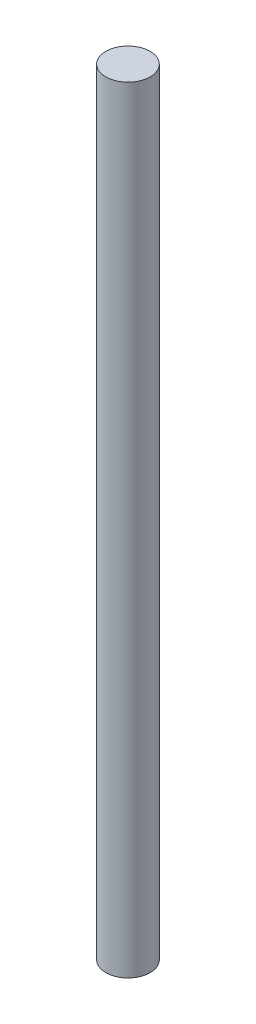
ISO-10303-21;
HEADER;
FILE_DESCRIPTION(('STEP AP214'),'2;1');
FILE_NAME('part.step','',(''),(''),'','','');
FILE_SCHEMA(('AUTOMOTIVE_DESIGN { 1 0 10303 214 1 1 1 1 }'));
ENDSEC;
DATA;
#1=APPLICATION_CONTEXT('core data for automotive mechanical design processes');
#2=APPLICATION_PROTOCOL_DEFINITION('international standard','automotive_design',2000,#1);
#3=PRODUCT_CONTEXT('',#1,'mechanical');
#4=PRODUCT('Part','Part','',(#3));
#5=PRODUCT_RELATED_PRODUCT_CATEGORY('part','',(#4));
#6=PRODUCT_DEFINITION_FORMATION('','',#4);
#7=PRODUCT_DEFINITION_CONTEXT('part definition',#1,'design');
#8=PRODUCT_DEFINITION('design','',#6,#7);
#9=PRODUCT_DEFINITION_SHAPE('','',#8);
#10=(LENGTH_UNIT() NAMED_UNIT(*) SI_UNIT(.MILLI.,.METRE.));
#11=(NAMED_UNIT(*) PLANE_ANGLE_UNIT() SI_UNIT($,.RADIAN.));
#12=(NAMED_UNIT(*) SI_UNIT($,.STERADIAN.) SOLID_ANGLE_UNIT());
#13=UNCERTAINTY_MEASURE_WITH_UNIT(LENGTH_MEASURE(1.E-05),#10,'distance_accuracy_value','');
#14=(GEOMETRIC_REPRESENTATION_CONTEXT(3) GLOBAL_UNCERTAINTY_ASSIGNED_CONTEXT((#13)) GLOBAL_UNIT_ASSIGNED_CONTEXT((#10,
#11,#12)) REPRESENTATION_CONTEXT('',''));
#15=CARTESIAN_POINT('',(0.,0.,0.));
#16=DIRECTION('',(0.,0.,1.));
#17=DIRECTION('',(1.,0.,0.));
#18=AXIS2_PLACEMENT_3D('',#15,#16,#17);
#19=CARTESIAN_POINT('',(0.,17.5,0.));
#20=DIRECTION('',(0.,-1.,0.));
#21=DIRECTION('',(0.,0.,-1.));
#22=AXIS2_PLACEMENT_3D('',#19,#20,#21);
#23=CYLINDRICAL_SURFACE('',#22,1.);
#24=CARTESIAN_POINT('',(0.,17.5,0.));
#25=DIRECTION('',(0.,1.,0.));
#26=DIRECTION('',(0.,0.,1.));
#27=AXIS2_PLACEMENT_3D('',#24,#25,#26);
#28=CIRCLE('',#27,1.);
#29=CARTESIAN_POINT('',(0.,17.5,1.));
#30=VERTEX_POINT('',#29);
#31=EDGE_CURVE('E10',#30,#30,#28,.T.);
#32=ORIENTED_EDGE('',*,*,#31,.F.);
#33=EDGE_LOOP('',(#32));
#34=FACE_BOUND('',#33,.T.);
#35=CARTESIAN_POINT('',(0.,-17.5,0.));
#36=DIRECTION('',(0.,1.,0.));
#37=DIRECTION('',(0.,0.,1.));
#38=AXIS2_PLACEMENT_3D('',#35,#36,#37);
#39=CIRCLE('',#38,1.);
#40=CARTESIAN_POINT('',(0.,-17.5,1.));
#41=VERTEX_POINT('',#40);
#42=EDGE_CURVE('E42',#41,#41,#39,.T.);
#43=ORIENTED_EDGE('',*,*,#42,.T.);
#44=EDGE_LOOP('',(#43));
#45=FACE_BOUND('',#44,.T.);
#46=ADVANCED_FACE('F39',(#34,#45),#23,.T.);
#47=CARTESIAN_POINT('',(0.,17.5,0.));
#48=DIRECTION('',(0.,1.,0.));
#49=DIRECTION('',(0.,0.,1.));
#50=AXIS2_PLACEMENT_3D('',#47,#48,#49);
#51=PLANE('',#50);
#52=ORIENTED_EDGE('',*,*,#31,.T.);
#53=EDGE_LOOP('',(#52));
#54=FACE_BOUND('',#53,.T.);
#55=ADVANCED_FACE('F54',(#54),#51,.T.);
#56=CARTESIAN_POINT('',(0.,-17.5,0.));
#57=DIRECTION('',(0.,1.,0.));
#58=DIRECTION('',(0.,0.,1.));
#59=AXIS2_PLACEMENT_3D('',#56,#57,#58);
#60=PLANE('',#59);
#61=ORIENTED_EDGE('',*,*,#42,.F.);
#62=EDGE_LOOP('',(#61));
#63=FACE_BOUND('',#62,.T.);
#64=ADVANCED_FACE('F52',(#63),#60,.F.);
#65=CLOSED_SHELL('',(#46,#55,#64));
#66=MANIFOLD_SOLID_BREP('B2',#65);
#67=ADVANCED_BREP_SHAPE_REPRESENTATION('',(#18,#66),#14);
#68=SHAPE_DEFINITION_REPRESENTATION(#9,#67);
ENDSEC;
END-ISO-10303-21;
